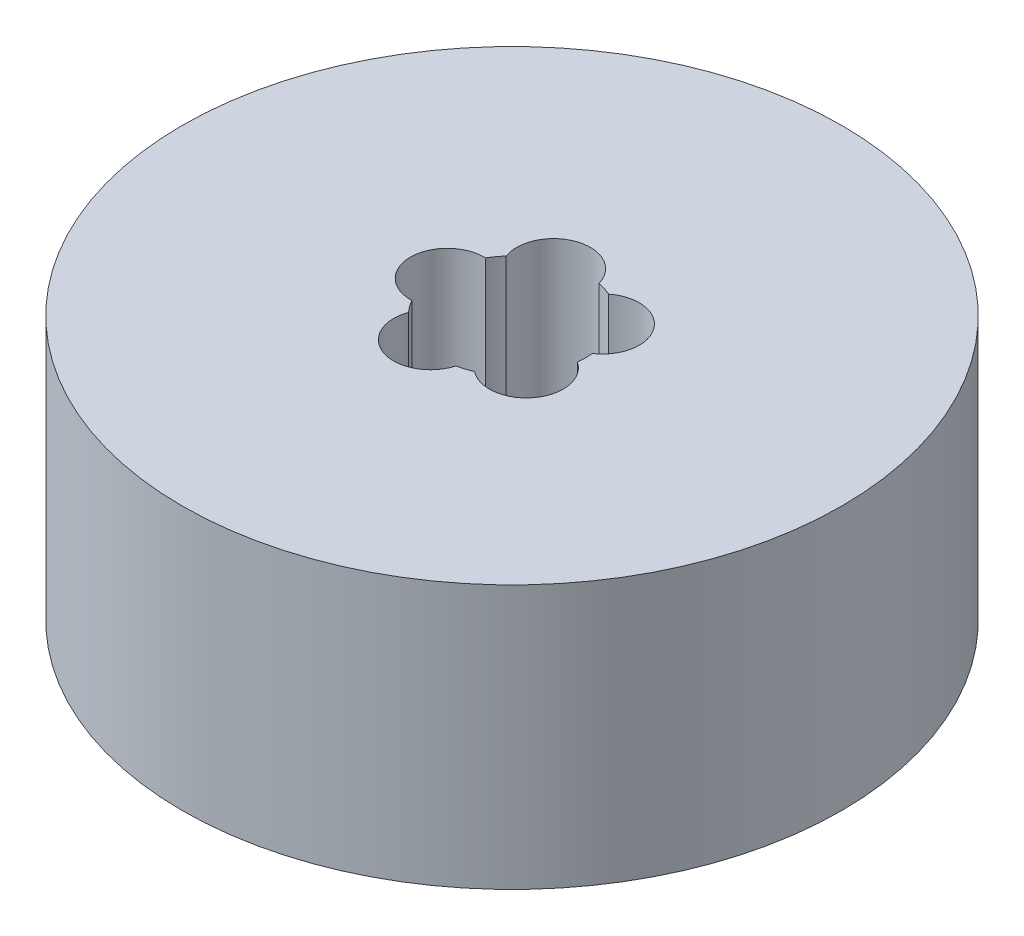
ISO-10303-21;
HEADER;
FILE_DESCRIPTION(('STEP AP214'),'2;1');
FILE_NAME('part.step','',(''),(''),'','','');
FILE_SCHEMA(('AUTOMOTIVE_DESIGN { 1 0 10303 214 1 1 1 1 }'));
ENDSEC;
DATA;
#1=APPLICATION_CONTEXT('core data for automotive mechanical design processes');
#2=APPLICATION_PROTOCOL_DEFINITION('international standard','automotive_design',2000,#1);
#3=PRODUCT_CONTEXT('',#1,'mechanical');
#4=PRODUCT('Part','Part','',(#3));
#5=PRODUCT_RELATED_PRODUCT_CATEGORY('part','',(#4));
#6=PRODUCT_DEFINITION_FORMATION('','',#4);
#7=PRODUCT_DEFINITION_CONTEXT('part definition',#1,'design');
#8=PRODUCT_DEFINITION('design','',#6,#7);
#9=PRODUCT_DEFINITION_SHAPE('','',#8);
#10=(LENGTH_UNIT() NAMED_UNIT(*) SI_UNIT(.MILLI.,.METRE.));
#11=(NAMED_UNIT(*) PLANE_ANGLE_UNIT() SI_UNIT($,.RADIAN.));
#12=(NAMED_UNIT(*) SI_UNIT($,.STERADIAN.) SOLID_ANGLE_UNIT());
#13=UNCERTAINTY_MEASURE_WITH_UNIT(LENGTH_MEASURE(1.E-05),#10,'distance_accuracy_value','');
#14=(GEOMETRIC_REPRESENTATION_CONTEXT(3) GLOBAL_UNCERTAINTY_ASSIGNED_CONTEXT((#13)) GLOBAL_UNIT_ASSIGNED_CONTEXT((#10,
#11,#12)) REPRESENTATION_CONTEXT('',''));
#15=CARTESIAN_POINT('',(0.,0.,0.));
#16=DIRECTION('',(0.,0.,1.));
#17=DIRECTION('',(1.,0.,0.));
#18=AXIS2_PLACEMENT_3D('',#15,#16,#17);
#19=CARTESIAN_POINT('',(0.,18.,0.));
#20=DIRECTION('',(0.,-1.,0.));
#21=DIRECTION('',(0.,0.,-1.));
#22=AXIS2_PLACEMENT_3D('',#19,#20,#21);
#23=CYLINDRICAL_SURFACE('',#22,22.5);
#24=CARTESIAN_POINT('',(0.,18.,0.));
#25=DIRECTION('',(0.,1.,0.));
#26=DIRECTION('',(0.,0.,1.));
#27=AXIS2_PLACEMENT_3D('',#24,#25,#26);
#28=CIRCLE('',#27,22.5);
#29=CARTESIAN_POINT('',(0.,18.,22.5));
#30=VERTEX_POINT('',#29);
#31=EDGE_CURVE('E156',#30,#30,#28,.T.);
#32=ORIENTED_EDGE('',*,*,#31,.F.);
#33=EDGE_LOOP('',(#32));
#34=FACE_BOUND('',#33,.T.);
#35=CARTESIAN_POINT('',(0.,0.,0.));
#36=DIRECTION('',(0.,1.,0.));
#37=DIRECTION('',(0.,0.,1.));
#38=AXIS2_PLACEMENT_3D('',#35,#36,#37);
#39=CIRCLE('',#38,22.5);
#40=CARTESIAN_POINT('',(0.,0.,22.5));
#41=VERTEX_POINT('',#40);
#42=EDGE_CURVE('E145',#41,#41,#39,.T.);
#43=ORIENTED_EDGE('',*,*,#42,.T.);
#44=EDGE_LOOP('',(#43));
#45=FACE_BOUND('',#44,.T.);
#46=ADVANCED_FACE('F39',(#34,#45),#23,.T.);
#47=CARTESIAN_POINT('',(0.,18.,0.));
#48=DIRECTION('',(0.,1.,0.));
#49=DIRECTION('',(0.,0.,1.));
#50=AXIS2_PLACEMENT_3D('',#47,#48,#49);
#51=PLANE('',#50);
#52=CARTESIAN_POINT('',(3.57076826494091,18.,2.59431500213145));
#53=DIRECTION('',(0.,1.,0.));
#54=DIRECTION('',(0.587785252292469,0.,-0.809016994374951));
#55=AXIS2_PLACEMENT_3D('',#52,#53,#54);
#56=CIRCLE('',#55,2.51602822406871);
#57=CARTESIAN_POINT('',(2.01852091204398,18.,4.57444787134373));
#58=VERTEX_POINT('',#57);
#59=CARTESIAN_POINT('',(4.97431572181676,18.,0.506145334549892));
#60=VERTEX_POINT('',#59);
#61=EDGE_CURVE('E139',#58,#60,#56,.T.);
#62=ORIENTED_EDGE('',*,*,#61,.F.);
#63=CARTESIAN_POINT('',(0.,18.,0.));
#64=DIRECTION('',(0.,1.,0.));
#65=DIRECTION('',(0.,0.,1.));
#66=AXIS2_PLACEMENT_3D('',#63,#64,#65);
#67=CIRCLE('',#66,5.);
#68=CARTESIAN_POINT('',(1.05577527481178,18.,4.88726289134277));
#69=VERTEX_POINT('',#68);
#70=EDGE_CURVE('E132',#69,#58,#67,.T.);
#71=ORIENTED_EDGE('',*,*,#70,.F.);
#72=CARTESIAN_POINT('',(-1.36391211125792,18.,4.19768985097248));
#73=DIRECTION('',(0.,1.,0.));
#74=DIRECTION('',(0.951056516295155,0.,0.309016994374945));
#75=AXIS2_PLACEMENT_3D('',#72,#73,#74);
#76=CIRCLE('',#75,2.51602822406871);
#77=CARTESIAN_POINT('',(-3.72680119117115,18.,3.33330959880497));
#78=VERTEX_POINT('',#77);
#79=EDGE_CURVE('E111',#78,#69,#76,.T.);
#80=ORIENTED_EDGE('',*,*,#79,.F.);
#81=CARTESIAN_POINT('',(-4.32181071750132,18.,2.514349244256));
#82=VERTEX_POINT('',#81);
#83=EDGE_CURVE('E143',#82,#78,#67,.T.);
#84=ORIENTED_EDGE('',*,*,#83,.F.);
#85=CARTESIAN_POINT('',(-4.41371230736592,18.,0.));
#86=DIRECTION('',(0.,1.,0.));
#87=DIRECTION('',(0.,0.,1.));
#88=AXIS2_PLACEMENT_3D('',#85,#86,#87);
#89=CIRCLE('',#88,2.51602822406871);
#90=CARTESIAN_POINT('',(-4.32181071750132,18.,-2.514349244256));
#91=VERTEX_POINT('',#90);
#92=EDGE_CURVE('E147',#91,#82,#89,.T.);
#93=ORIENTED_EDGE('',*,*,#92,.F.);
#94=CARTESIAN_POINT('',(-3.72680119117119,18.,-3.33330959880491));
#95=VERTEX_POINT('',#94);
#96=EDGE_CURVE('E144',#95,#91,#67,.T.);
#97=ORIENTED_EDGE('',*,*,#96,.F.);
#98=CARTESIAN_POINT('',(-1.36391211125798,18.,-4.19768985097246));
#99=DIRECTION('',(0.,1.,0.));
#100=DIRECTION('',(-0.95105651629515,0.,0.309016994374958));
#101=AXIS2_PLACEMENT_3D('',#98,#99,#100);
#102=CIRCLE('',#101,2.51602822406871);
#103=CARTESIAN_POINT('',(1.05577527481171,18.,-4.88726289134279));
#104=VERTEX_POINT('',#103);
#105=EDGE_CURVE('E326',#104,#95,#102,.T.);
#106=ORIENTED_EDGE('',*,*,#105,.F.);
#107=CARTESIAN_POINT('',(2.01852091204391,18.,-4.57444787134375));
#108=VERTEX_POINT('',#107);
#109=EDGE_CURVE('E150',#108,#104,#67,.T.);
#110=ORIENTED_EDGE('',*,*,#109,.F.);
#111=CARTESIAN_POINT('',(3.57076826494087,18.,-2.5943150021315));
#112=DIRECTION('',(0.,1.,0.));
#113=DIRECTION('',(-0.58778525229248,0.,-0.809016994374942));
#114=AXIS2_PLACEMENT_3D('',#111,#112,#113);
#115=CIRCLE('',#114,2.51602822406871);
#116=CARTESIAN_POINT('',(4.97431572181675,18.,-0.506145334549964));
#117=VERTEX_POINT('',#116);
#118=EDGE_CURVE('E341',#117,#108,#115,.T.);
#119=ORIENTED_EDGE('',*,*,#118,.F.);
#120=EDGE_CURVE('E142',#60,#117,#67,.T.);
#121=ORIENTED_EDGE('',*,*,#120,.F.);
#122=EDGE_LOOP('',(#62,#71,#80,#84,#93,#97,#106,#110,#119,#121));
#123=FACE_BOUND('',#122,.T.);
#124=ORIENTED_EDGE('',*,*,#31,.T.);
#125=EDGE_LOOP('',(#124));
#126=FACE_BOUND('',#125,.T.);
#127=ADVANCED_FACE('F140',(#123,#126),#51,.T.);
#128=CARTESIAN_POINT('',(0.,0.,0.));
#129=DIRECTION('',(0.,1.,0.));
#130=DIRECTION('',(0.,0.,1.));
#131=AXIS2_PLACEMENT_3D('',#128,#129,#130);
#132=PLANE('',#131);
#133=CARTESIAN_POINT('',(0.,0.,0.));
#134=DIRECTION('',(0.,1.,0.));
#135=DIRECTION('',(0.,0.,1.));
#136=AXIS2_PLACEMENT_3D('',#133,#134,#135);
#137=CIRCLE('',#136,5.);
#138=CARTESIAN_POINT('',(0.,0.,5.));
#139=VERTEX_POINT('',#138);
#140=EDGE_CURVE('E155',#139,#139,#137,.T.);
#141=ORIENTED_EDGE('',*,*,#140,.T.);
#142=EDGE_LOOP('',(#141));
#143=FACE_BOUND('',#142,.T.);
#144=ORIENTED_EDGE('',*,*,#42,.F.);
#145=EDGE_LOOP('',(#144));
#146=FACE_BOUND('',#145,.T.);
#147=ADVANCED_FACE('F210',(#143,#146),#132,.F.);
#148=CARTESIAN_POINT('',(0.,18.,0.));
#149=DIRECTION('',(0.,-1.,0.));
#150=DIRECTION('',(0.,0.,-1.));
#151=AXIS2_PLACEMENT_3D('',#148,#149,#150);
#152=CYLINDRICAL_SURFACE('',#151,5.);
#153=DIRECTION('',(0.,1.,0.));
#154=VECTOR('',#153,1.);
#155=CARTESIAN_POINT('',(2.01852091204398,9.55301817550116,4.57444787134373));
#156=LINE('',#155,#154);
#157=CARTESIAN_POINT('',(2.01852091204398,1.10603635100232,4.57444787134373));
#158=VERTEX_POINT('',#157);
#159=EDGE_CURVE('E11',#158,#58,#156,.T.);
#160=ORIENTED_EDGE('',*,*,#159,.F.);
#161=CARTESIAN_POINT('',(0.,1.10603635100232,0.));
#162=DIRECTION('',(0.,1.,0.));
#163=DIRECTION('',(0.,0.,1.));
#164=AXIS2_PLACEMENT_3D('',#161,#162,#163);
#165=CIRCLE('',#164,5.);
#166=CARTESIAN_POINT('',(4.97431572181676,1.10603635100232,0.506145334549892));
#167=VERTEX_POINT('',#166);
#168=EDGE_CURVE('E190',#158,#167,#165,.T.);
#169=ORIENTED_EDGE('',*,*,#168,.T.);
#170=DIRECTION('',(0.,1.,0.));
#171=VECTOR('',#170,1.);
#172=CARTESIAN_POINT('',(4.97431572181676,9.55301817550116,0.506145334549891));
#173=LINE('',#172,#171);
#174=EDGE_CURVE('E46',#60,#167,#173,.F.);
#175=ORIENTED_EDGE('',*,*,#174,.F.);
#176=ORIENTED_EDGE('',*,*,#120,.T.);
#177=DIRECTION('',(0.,1.,0.));
#178=VECTOR('',#177,1.);
#179=CARTESIAN_POINT('',(4.97431572181675,9.55301817550116,-0.506145334549964));
#180=LINE('',#179,#178);
#181=CARTESIAN_POINT('',(4.97431572181675,1.10603635100232,-0.506145334549964));
#182=VERTEX_POINT('',#181);
#183=EDGE_CURVE('E183',#182,#117,#180,.T.);
#184=ORIENTED_EDGE('',*,*,#183,.F.);
#185=CARTESIAN_POINT('',(0.,1.10603635100232,0.));
#186=DIRECTION('',(0.,1.,0.));
#187=DIRECTION('',(0.,0.,1.));
#188=AXIS2_PLACEMENT_3D('',#185,#186,#187);
#189=CIRCLE('',#188,5.);
#190=CARTESIAN_POINT('',(2.01852091204391,1.10603635100232,-4.57444787134375));
#191=VERTEX_POINT('',#190);
#192=EDGE_CURVE('E179',#182,#191,#189,.T.);
#193=ORIENTED_EDGE('',*,*,#192,.T.);
#194=DIRECTION('',(0.,1.,0.));
#195=VECTOR('',#194,1.);
#196=CARTESIAN_POINT('',(2.01852091204391,9.55301817550116,-4.57444787134375));
#197=LINE('',#196,#195);
#198=EDGE_CURVE('E181',#108,#191,#197,.F.);
#199=ORIENTED_EDGE('',*,*,#198,.F.);
#200=ORIENTED_EDGE('',*,*,#109,.T.);
#201=DIRECTION('',(0.,1.,0.));
#202=VECTOR('',#201,1.);
#203=CARTESIAN_POINT('',(1.05577527481171,9.55301817550116,-4.88726289134279));
#204=LINE('',#203,#202);
#205=CARTESIAN_POINT('',(1.05577527481171,1.10603635100232,-4.88726289134279));
#206=VERTEX_POINT('',#205);
#207=EDGE_CURVE('E177',#206,#104,#204,.T.);
#208=ORIENTED_EDGE('',*,*,#207,.F.);
#209=CARTESIAN_POINT('',(0.,1.10603635100232,0.));
#210=DIRECTION('',(0.,1.,0.));
#211=DIRECTION('',(0.,0.,1.));
#212=AXIS2_PLACEMENT_3D('',#209,#210,#211);
#213=CIRCLE('',#212,5.);
#214=CARTESIAN_POINT('',(-3.72680119117119,1.10603635100232,-3.33330959880491));
#215=VERTEX_POINT('',#214);
#216=EDGE_CURVE('E175',#206,#215,#213,.T.);
#217=ORIENTED_EDGE('',*,*,#216,.T.);
#218=DIRECTION('',(0.,1.,0.));
#219=VECTOR('',#218,1.);
#220=CARTESIAN_POINT('',(-3.72680119117119,9.55301817550116,-3.33330959880491));
#221=LINE('',#220,#219);
#222=EDGE_CURVE('E174',#95,#215,#221,.F.);
#223=ORIENTED_EDGE('',*,*,#222,.F.);
#224=ORIENTED_EDGE('',*,*,#96,.T.);
#225=DIRECTION('',(0.,1.,0.));
#226=VECTOR('',#225,1.);
#227=CARTESIAN_POINT('',(-4.32181071750132,9.55301817550116,-2.514349244256));
#228=LINE('',#227,#226);
#229=CARTESIAN_POINT('',(-4.32181071750132,1.10603635100232,-2.514349244256));
#230=VERTEX_POINT('',#229);
#231=EDGE_CURVE('E170',#230,#91,#228,.T.);
#232=ORIENTED_EDGE('',*,*,#231,.F.);
#233=CARTESIAN_POINT('',(0.,1.10603635100232,0.));
#234=DIRECTION('',(0.,1.,0.));
#235=DIRECTION('',(0.,0.,1.));
#236=AXIS2_PLACEMENT_3D('',#233,#234,#235);
#237=CIRCLE('',#236,5.);
#238=CARTESIAN_POINT('',(-4.32181071750132,1.10603635100232,2.514349244256));
#239=VERTEX_POINT('',#238);
#240=EDGE_CURVE('E157',#230,#239,#237,.T.);
#241=ORIENTED_EDGE('',*,*,#240,.T.);
#242=DIRECTION('',(0.,1.,0.));
#243=VECTOR('',#242,1.);
#244=CARTESIAN_POINT('',(-4.32181071750132,9.55301817550116,2.514349244256));
#245=LINE('',#244,#243);
#246=EDGE_CURVE('E163',#82,#239,#245,.F.);
#247=ORIENTED_EDGE('',*,*,#246,.F.);
#248=ORIENTED_EDGE('',*,*,#83,.T.);
#249=DIRECTION('',(0.,1.,0.));
#250=VECTOR('',#249,1.);
#251=CARTESIAN_POINT('',(-3.72680119117115,9.55301817550116,3.33330959880497));
#252=LINE('',#251,#250);
#253=CARTESIAN_POINT('',(-3.72680119117115,1.10603635100232,3.33330959880497));
#254=VERTEX_POINT('',#253);
#255=EDGE_CURVE('E121',#254,#78,#252,.T.);
#256=ORIENTED_EDGE('',*,*,#255,.F.);
#257=CARTESIAN_POINT('',(0.,1.10603635100232,0.));
#258=DIRECTION('',(0.,1.,0.));
#259=DIRECTION('',(0.,0.,1.));
#260=AXIS2_PLACEMENT_3D('',#257,#258,#259);
#261=CIRCLE('',#260,5.);
#262=CARTESIAN_POINT('',(1.05577527481178,1.10603635100232,4.88726289134277));
#263=VERTEX_POINT('',#262);
#264=EDGE_CURVE('E133',#254,#263,#261,.T.);
#265=ORIENTED_EDGE('',*,*,#264,.T.);
#266=DIRECTION('',(0.,1.,0.));
#267=VECTOR('',#266,1.);
#268=CARTESIAN_POINT('',(1.05577527481178,9.55301817550116,4.88726289134277));
#269=LINE('',#268,#267);
#270=EDGE_CURVE('E117',#69,#263,#269,.F.);
#271=ORIENTED_EDGE('',*,*,#270,.F.);
#272=ORIENTED_EDGE('',*,*,#70,.T.);
#273=EDGE_LOOP('',(#160,#169,#175,#176,#184,#193,#199,#200,#208,#217,#223,#224,#232,#241,#247,
#248,#256,#265,#271,#272));
#274=FACE_BOUND('',#273,.T.);
#275=ORIENTED_EDGE('',*,*,#140,.F.);
#276=EDGE_LOOP('',(#275));
#277=FACE_BOUND('',#276,.T.);
#278=ADVANCED_FACE('F131',(#274,#277),#152,.F.);
#279=CARTESIAN_POINT('',(-4.41371230736592,1.10603635100232,0.));
#280=DIRECTION('',(0.,1.,0.));
#281=DIRECTION('',(0.,0.,1.));
#282=AXIS2_PLACEMENT_3D('',#279,#280,#281);
#283=CYLINDRICAL_SURFACE('',#282,2.51602822406871);
#284=ORIENTED_EDGE('',*,*,#231,.T.);
#285=ORIENTED_EDGE('',*,*,#92,.T.);
#286=ORIENTED_EDGE('',*,*,#246,.T.);
#287=CARTESIAN_POINT('',(-4.41371230736592,1.10603635100232,0.));
#288=DIRECTION('',(0.,1.,0.));
#289=DIRECTION('',(0.,0.,1.));
#290=AXIS2_PLACEMENT_3D('',#287,#288,#289);
#291=CIRCLE('',#290,2.51602822406871);
#292=EDGE_CURVE('E154',#230,#239,#291,.T.);
#293=ORIENTED_EDGE('',*,*,#292,.F.);
#294=EDGE_LOOP('',(#284,#285,#286,#293));
#295=FACE_BOUND('',#294,.T.);
#296=ADVANCED_FACE('F217',(#295),#283,.F.);
#297=CARTESIAN_POINT('',(-4.41371230736592,1.10603635100232,0.));
#298=DIRECTION('',(0.,1.,0.));
#299=DIRECTION('',(0.,0.,1.));
#300=AXIS2_PLACEMENT_3D('',#297,#298,#299);
#301=PLANE('',#300);
#302=ORIENTED_EDGE('',*,*,#292,.T.);
#303=ORIENTED_EDGE('',*,*,#240,.F.);
#304=EDGE_LOOP('',(#302,#303));
#305=FACE_BOUND('',#304,.T.);
#306=ADVANCED_FACE('F225',(#305),#301,.T.);
#307=CARTESIAN_POINT('',(-1.36391211125792,1.10603635100232,4.19768985097248));
#308=DIRECTION('',(0.,1.,0.));
#309=DIRECTION('',(0.,0.,1.));
#310=AXIS2_PLACEMENT_3D('',#307,#308,#309);
#311=CYLINDRICAL_SURFACE('',#310,2.51602822406871);
#312=ORIENTED_EDGE('',*,*,#255,.T.);
#313=ORIENTED_EDGE('',*,*,#79,.T.);
#314=ORIENTED_EDGE('',*,*,#270,.T.);
#315=CARTESIAN_POINT('',(-1.36391211125792,1.10603635100232,4.19768985097248));
#316=DIRECTION('',(0.,1.,0.));
#317=DIRECTION('',(0.951056516295155,0.,0.309016994374945));
#318=AXIS2_PLACEMENT_3D('',#315,#316,#317);
#319=CIRCLE('',#318,2.51602822406871);
#320=EDGE_CURVE('E127',#254,#263,#319,.T.);
#321=ORIENTED_EDGE('',*,*,#320,.F.);
#322=EDGE_LOOP('',(#312,#313,#314,#321));
#323=FACE_BOUND('',#322,.T.);
#324=ADVANCED_FACE('F116',(#323),#311,.F.);
#325=CARTESIAN_POINT('',(-1.36391211125792,1.10603635100232,4.19768985097248));
#326=DIRECTION('',(0.,1.,0.));
#327=DIRECTION('',(0.951056516295155,0.,0.309016994374945));
#328=AXIS2_PLACEMENT_3D('',#325,#326,#327);
#329=PLANE('',#328);
#330=ORIENTED_EDGE('',*,*,#320,.T.);
#331=ORIENTED_EDGE('',*,*,#264,.F.);
#332=EDGE_LOOP('',(#330,#331));
#333=FACE_BOUND('',#332,.T.);
#334=ADVANCED_FACE('F228',(#333),#329,.T.);
#335=CARTESIAN_POINT('',(-1.36391211125798,1.10603635100232,-4.19768985097246));
#336=DIRECTION('',(0.,1.,0.));
#337=DIRECTION('',(0.,0.,1.));
#338=AXIS2_PLACEMENT_3D('',#335,#336,#337);
#339=CYLINDRICAL_SURFACE('',#338,2.51602822406871);
#340=ORIENTED_EDGE('',*,*,#207,.T.);
#341=ORIENTED_EDGE('',*,*,#105,.T.);
#342=ORIENTED_EDGE('',*,*,#222,.T.);
#343=CARTESIAN_POINT('',(-1.36391211125798,1.10603635100232,-4.19768985097246));
#344=DIRECTION('',(0.,1.,0.));
#345=DIRECTION('',(-0.95105651629515,0.,0.309016994374958));
#346=AXIS2_PLACEMENT_3D('',#343,#344,#345);
#347=CIRCLE('',#346,2.51602822406871);
#348=EDGE_CURVE('E327',#206,#215,#347,.T.);
#349=ORIENTED_EDGE('',*,*,#348,.F.);
#350=EDGE_LOOP('',(#340,#341,#342,#349));
#351=FACE_BOUND('',#350,.T.);
#352=ADVANCED_FACE('F235',(#351),#339,.F.);
#353=CARTESIAN_POINT('',(-1.36391211125798,1.10603635100232,-4.19768985097246));
#354=DIRECTION('',(0.,1.,0.));
#355=DIRECTION('',(-0.95105651629515,0.,0.309016994374958));
#356=AXIS2_PLACEMENT_3D('',#353,#354,#355);
#357=PLANE('',#356);
#358=ORIENTED_EDGE('',*,*,#348,.T.);
#359=ORIENTED_EDGE('',*,*,#216,.F.);
#360=EDGE_LOOP('',(#358,#359));
#361=FACE_BOUND('',#360,.T.);
#362=ADVANCED_FACE('F240',(#361),#357,.T.);
#363=CARTESIAN_POINT('',(3.57076826494087,1.10603635100232,-2.5943150021315));
#364=DIRECTION('',(0.,1.,0.));
#365=DIRECTION('',(0.,0.,1.));
#366=AXIS2_PLACEMENT_3D('',#363,#364,#365);
#367=CYLINDRICAL_SURFACE('',#366,2.51602822406871);
#368=ORIENTED_EDGE('',*,*,#183,.T.);
#369=ORIENTED_EDGE('',*,*,#118,.T.);
#370=ORIENTED_EDGE('',*,*,#198,.T.);
#371=CARTESIAN_POINT('',(3.57076826494087,1.10603635100232,-2.5943150021315));
#372=DIRECTION('',(0.,1.,0.));
#373=DIRECTION('',(-0.58778525229248,0.,-0.809016994374942));
#374=AXIS2_PLACEMENT_3D('',#371,#372,#373);
#375=CIRCLE('',#374,2.51602822406871);
#376=EDGE_CURVE('E56',#182,#191,#375,.T.);
#377=ORIENTED_EDGE('',*,*,#376,.F.);
#378=EDGE_LOOP('',(#368,#369,#370,#377));
#379=FACE_BOUND('',#378,.T.);
#380=ADVANCED_FACE('F233',(#379),#367,.F.);
#381=CARTESIAN_POINT('',(3.57076826494087,1.10603635100232,-2.5943150021315));
#382=DIRECTION('',(0.,1.,0.));
#383=DIRECTION('',(-0.58778525229248,0.,-0.809016994374942));
#384=AXIS2_PLACEMENT_3D('',#381,#382,#383);
#385=PLANE('',#384);
#386=ORIENTED_EDGE('',*,*,#376,.T.);
#387=ORIENTED_EDGE('',*,*,#192,.F.);
#388=EDGE_LOOP('',(#386,#387));
#389=FACE_BOUND('',#388,.T.);
#390=ADVANCED_FACE('F196',(#389),#385,.T.);
#391=CARTESIAN_POINT('',(3.57076826494091,1.10603635100232,2.59431500213145));
#392=DIRECTION('',(0.,1.,0.));
#393=DIRECTION('',(0.,0.,1.));
#394=AXIS2_PLACEMENT_3D('',#391,#392,#393);
#395=CYLINDRICAL_SURFACE('',#394,2.51602822406871);
#396=ORIENTED_EDGE('',*,*,#159,.T.);
#397=ORIENTED_EDGE('',*,*,#61,.T.);
#398=ORIENTED_EDGE('',*,*,#174,.T.);
#399=CARTESIAN_POINT('',(3.57076826494091,1.10603635100232,2.59431500213145));
#400=DIRECTION('',(0.,1.,0.));
#401=DIRECTION('',(0.587785252292469,0.,-0.809016994374951));
#402=AXIS2_PLACEMENT_3D('',#399,#400,#401);
#403=CIRCLE('',#402,2.51602822406871);
#404=EDGE_CURVE('E55',#158,#167,#403,.T.);
#405=ORIENTED_EDGE('',*,*,#404,.F.);
#406=EDGE_LOOP('',(#396,#397,#398,#405));
#407=FACE_BOUND('',#406,.T.);
#408=ADVANCED_FACE('F191',(#407),#395,.F.);
#409=CARTESIAN_POINT('',(3.57076826494091,1.10603635100232,2.59431500213145));
#410=DIRECTION('',(0.,1.,0.));
#411=DIRECTION('',(0.587785252292469,0.,-0.809016994374951));
#412=AXIS2_PLACEMENT_3D('',#409,#410,#411);
#413=PLANE('',#412);
#414=ORIENTED_EDGE('',*,*,#404,.T.);
#415=ORIENTED_EDGE('',*,*,#168,.F.);
#416=EDGE_LOOP('',(#414,#415));
#417=FACE_BOUND('',#416,.T.);
#418=ADVANCED_FACE('F195',(#417),#413,.T.);
#419=CLOSED_SHELL('',(#46,#127,#147,#278,#296,#306,#324,#334,#352,#362,#380,#390,#408,#418));
#420=MANIFOLD_SOLID_BREP('B2',#419);
#421=ADVANCED_BREP_SHAPE_REPRESENTATION('',(#18,#420),#14);
#422=SHAPE_DEFINITION_REPRESENTATION(#9,#421);
ENDSEC;
END-ISO-10303-21;
